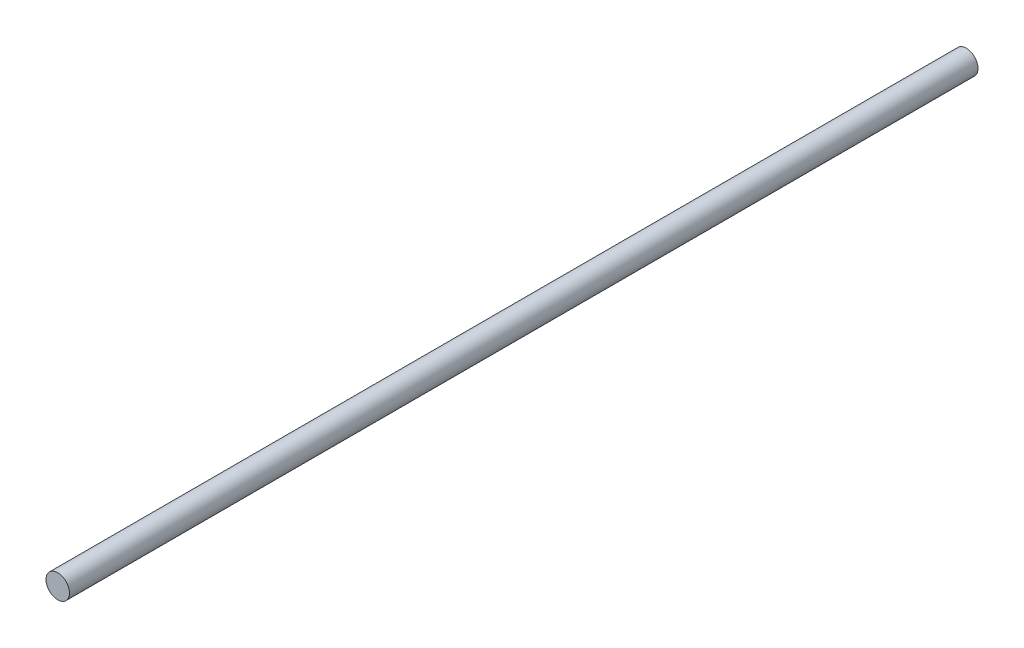
ISO-10303-21;
HEADER;
FILE_DESCRIPTION(('STEP AP214'),'2;1');
FILE_NAME('part.step','',(''),(''),'','','');
FILE_SCHEMA(('AUTOMOTIVE_DESIGN { 1 0 10303 214 1 1 1 1 }'));
ENDSEC;
DATA;
#1=APPLICATION_CONTEXT('core data for automotive mechanical design processes');
#2=APPLICATION_PROTOCOL_DEFINITION('international standard','automotive_design',2000,#1);
#3=PRODUCT_CONTEXT('',#1,'mechanical');
#4=PRODUCT('Part','Part','',(#3));
#5=PRODUCT_RELATED_PRODUCT_CATEGORY('part','',(#4));
#6=PRODUCT_DEFINITION_FORMATION('','',#4);
#7=PRODUCT_DEFINITION_CONTEXT('part definition',#1,'design');
#8=PRODUCT_DEFINITION('design','',#6,#7);
#9=PRODUCT_DEFINITION_SHAPE('','',#8);
#10=(LENGTH_UNIT() NAMED_UNIT(*) SI_UNIT(.MILLI.,.METRE.));
#11=(NAMED_UNIT(*) PLANE_ANGLE_UNIT() SI_UNIT($,.RADIAN.));
#12=(NAMED_UNIT(*) SI_UNIT($,.STERADIAN.) SOLID_ANGLE_UNIT());
#13=UNCERTAINTY_MEASURE_WITH_UNIT(LENGTH_MEASURE(1.E-05),#10,'distance_accuracy_value','');
#14=(GEOMETRIC_REPRESENTATION_CONTEXT(3) GLOBAL_UNCERTAINTY_ASSIGNED_CONTEXT((#13)) GLOBAL_UNIT_ASSIGNED_CONTEXT((#10,
#11,#12)) REPRESENTATION_CONTEXT('',''));
#15=CARTESIAN_POINT('',(0.,0.,0.));
#16=DIRECTION('',(0.,0.,1.));
#17=DIRECTION('',(1.,0.,0.));
#18=AXIS2_PLACEMENT_3D('',#15,#16,#17);
#19=CARTESIAN_POINT('',(-1.23170731690639,13.735161580011,-386.999999999989));
#20=DIRECTION('',(0.,0.,-1.));
#21=DIRECTION('',(-1.,-2.82510126403679E-13,0.));
#22=AXIS2_PLACEMENT_3D('',#19,#20,#21);
#23=PLANE('',#22);
#24=CARTESIAN_POINT('',(-1.23170731690248,13.7351615800115,-386.999999999989));
#25=DIRECTION('',(0.,0.,-1.));
#26=DIRECTION('',(0.,1.,0.));
#27=AXIS2_PLACEMENT_3D('',#24,#25,#26);
#28=CIRCLE('',#27,5.);
#29=CARTESIAN_POINT('',(-1.23170731690248,18.7351615800115,-386.999999999989));
#30=VERTEX_POINT('',#29);
#31=EDGE_CURVE('E10',#30,#30,#28,.F.);
#32=ORIENTED_EDGE('',*,*,#31,.F.);
#33=EDGE_LOOP('',(#32));
#34=FACE_BOUND('',#33,.T.);
#35=ADVANCED_FACE('F33',(#34),#23,.T.);
#36=CARTESIAN_POINT('',(-1.23170731690248,13.7351615800115,0.));
#37=DIRECTION('',(0.,0.,1.));
#38=DIRECTION('',(1.,0.,0.));
#39=AXIS2_PLACEMENT_3D('',#36,#37,#38);
#40=PLANE('',#39);
#41=CARTESIAN_POINT('',(-1.23170731690248,13.7351615800115,0.));
#42=DIRECTION('',(0.,0.,1.));
#43=DIRECTION('',(1.,0.,0.));
#44=AXIS2_PLACEMENT_3D('',#41,#42,#43);
#45=CIRCLE('',#44,5.);
#46=CARTESIAN_POINT('',(3.76829268309753,13.7351615800115,0.));
#47=VERTEX_POINT('',#46);
#48=EDGE_CURVE('E39',#47,#47,#45,.T.);
#49=ORIENTED_EDGE('',*,*,#48,.T.);
#50=EDGE_LOOP('',(#49));
#51=FACE_BOUND('',#50,.T.);
#52=ADVANCED_FACE('F45',(#51),#40,.T.);
#53=CARTESIAN_POINT('',(-1.23170731690248,13.7351615800115,-401.14213562372));
#54=DIRECTION('',(0.,0.,1.));
#55=DIRECTION('',(1.,0.,0.));
#56=AXIS2_PLACEMENT_3D('',#53,#54,#55);
#57=CYLINDRICAL_SURFACE('',#56,5.);
#58=ORIENTED_EDGE('',*,*,#48,.F.);
#59=EDGE_LOOP('',(#58));
#60=FACE_BOUND('',#59,.T.);
#61=ORIENTED_EDGE('',*,*,#31,.T.);
#62=EDGE_LOOP('',(#61));
#63=FACE_BOUND('',#62,.T.);
#64=ADVANCED_FACE('F47',(#60,#63),#57,.T.);
#65=CLOSED_SHELL('',(#35,#52,#64));
#66=MANIFOLD_SOLID_BREP('B2',#65);
#67=ADVANCED_BREP_SHAPE_REPRESENTATION('',(#18,#66),#14);
#68=SHAPE_DEFINITION_REPRESENTATION(#9,#67);
ENDSEC;
END-ISO-10303-21;
